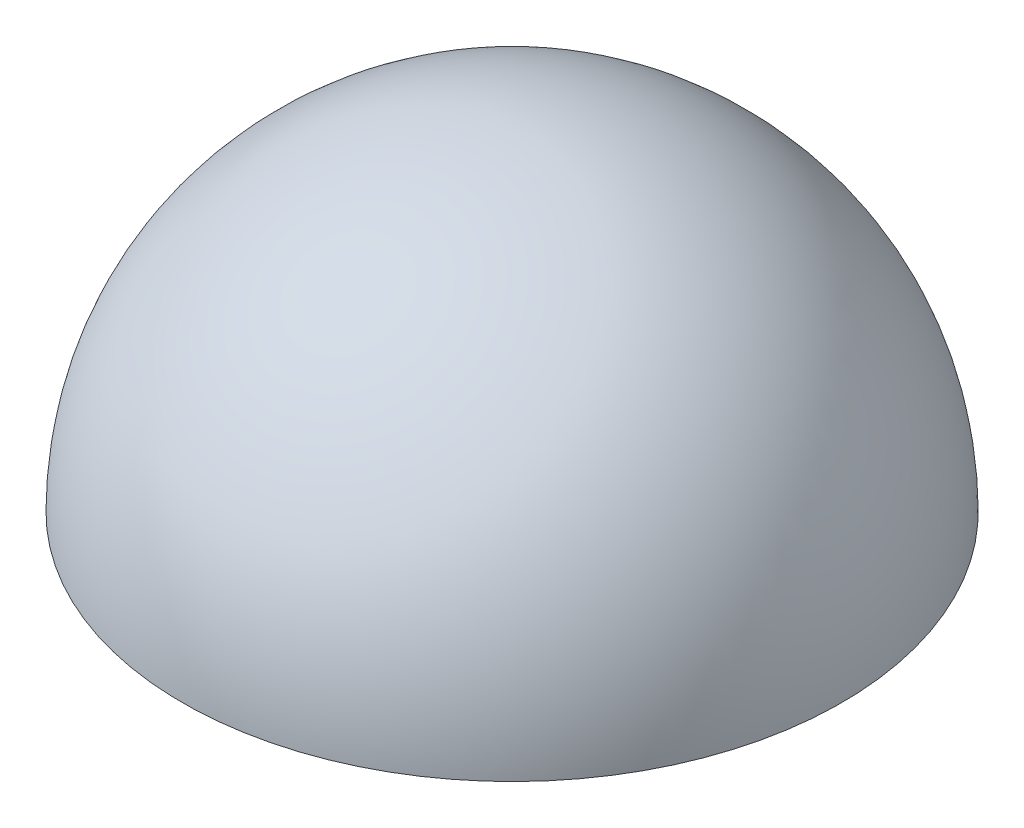
ISO-10303-21;
HEADER;
FILE_DESCRIPTION(('STEP AP214'),'2;1');
FILE_NAME('part.step','',(''),(''),'','','');
FILE_SCHEMA(('AUTOMOTIVE_DESIGN { 1 0 10303 214 1 1 1 1 }'));
ENDSEC;
DATA;
#1=APPLICATION_CONTEXT('core data for automotive mechanical design processes');
#2=APPLICATION_PROTOCOL_DEFINITION('international standard','automotive_design',2000,#1);
#3=PRODUCT_CONTEXT('',#1,'mechanical');
#4=PRODUCT('Part','Part','',(#3));
#5=PRODUCT_RELATED_PRODUCT_CATEGORY('part','',(#4));
#6=PRODUCT_DEFINITION_FORMATION('','',#4);
#7=PRODUCT_DEFINITION_CONTEXT('part definition',#1,'design');
#8=PRODUCT_DEFINITION('design','',#6,#7);
#9=PRODUCT_DEFINITION_SHAPE('','',#8);
#10=(LENGTH_UNIT() NAMED_UNIT(*) SI_UNIT(.MILLI.,.METRE.));
#11=(NAMED_UNIT(*) PLANE_ANGLE_UNIT() SI_UNIT($,.RADIAN.));
#12=(NAMED_UNIT(*) SI_UNIT($,.STERADIAN.) SOLID_ANGLE_UNIT());
#13=UNCERTAINTY_MEASURE_WITH_UNIT(LENGTH_MEASURE(1.E-05),#10,'distance_accuracy_value','');
#14=(GEOMETRIC_REPRESENTATION_CONTEXT(3) GLOBAL_UNCERTAINTY_ASSIGNED_CONTEXT((#13)) GLOBAL_UNIT_ASSIGNED_CONTEXT((#10,
#11,#12)) REPRESENTATION_CONTEXT('',''));
#15=CARTESIAN_POINT('',(0.,0.,0.));
#16=DIRECTION('',(0.,0.,1.));
#17=DIRECTION('',(1.,0.,0.));
#18=AXIS2_PLACEMENT_3D('',#15,#16,#17);
#19=CARTESIAN_POINT('',(0.,-54.9662706692072,7.03359861643882));
#20=DIRECTION('',(0.,-1.,0.));
#21=DIRECTION('',(0.,0.,-1.));
#22=AXIS2_PLACEMENT_3D('',#19,#20,#21);
#23=SPHERICAL_SURFACE('',#22,3.5);
#24=CARTESIAN_POINT('',(0.,-54.9662706692072,7.03359861643882));
#25=DIRECTION('',(0.,-1.,0.));
#26=DIRECTION('',(0.,0.,-1.));
#27=AXIS2_PLACEMENT_3D('',#24,#25,#26);
#28=CIRCLE('',#27,3.5);
#29=CARTESIAN_POINT('',(0.,-54.9662706692072,3.53359861643882));
#30=VERTEX_POINT('',#29);
#31=EDGE_CURVE('E12',#30,#30,#28,.T.);
#32=ORIENTED_EDGE('',*,*,#31,.F.);
#33=EDGE_LOOP('',(#32));
#34=FACE_BOUND('',#33,.T.);
#35=ADVANCED_FACE('F45',(#34),#23,.T.);
#36=CARTESIAN_POINT('',(0.,-54.9662706692072,7.03359861643882));
#37=DIRECTION('',(0.,-1.,0.));
#38=DIRECTION('',(0.,0.,-1.));
#39=AXIS2_PLACEMENT_3D('',#36,#37,#38);
#40=PLANE('',#39);
#41=ORIENTED_EDGE('',*,*,#31,.T.);
#42=EDGE_LOOP('',(#41));
#43=FACE_BOUND('',#42,.T.);
#44=ADVANCED_FACE('F52',(#43),#40,.T.);
#45=CLOSED_SHELL('',(#35,#44));
#46=MANIFOLD_SOLID_BREP('B2',#45);
#47=ADVANCED_BREP_SHAPE_REPRESENTATION('',(#18,#46),#14);
#48=SHAPE_DEFINITION_REPRESENTATION(#9,#47);
ENDSEC;
END-ISO-10303-21;
